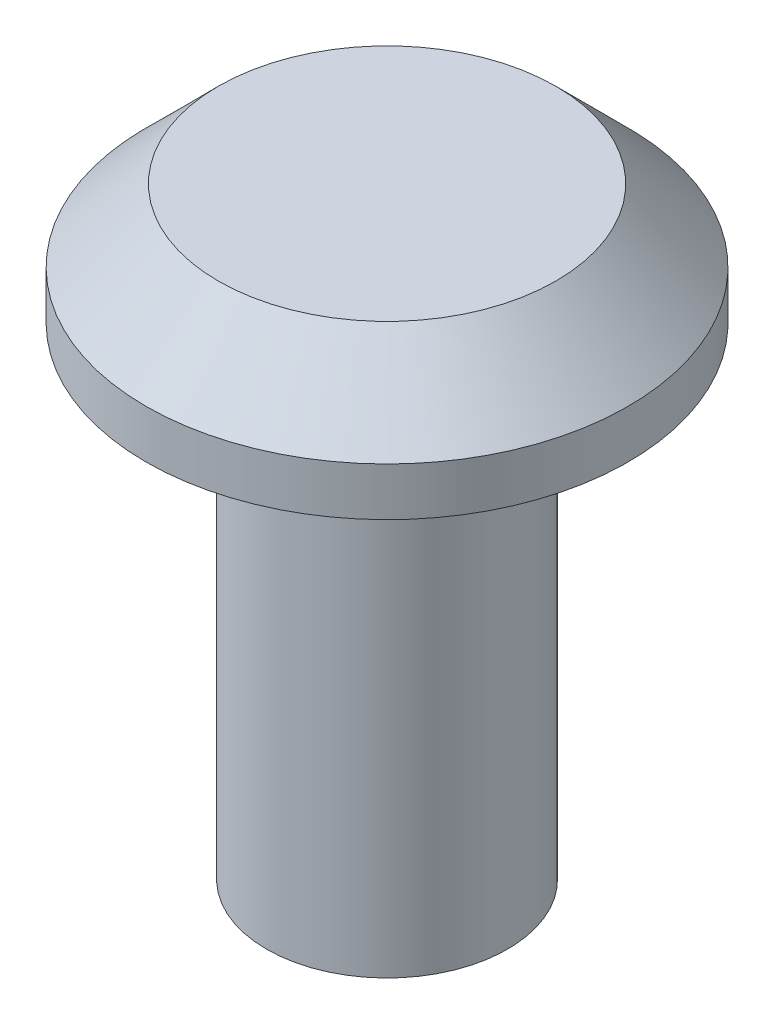
ISO-10303-21;
HEADER;
FILE_DESCRIPTION(('STEP AP214'),'2;1');
FILE_NAME('part.step','',(''),(''),'','','');
FILE_SCHEMA(('AUTOMOTIVE_DESIGN { 1 0 10303 214 1 1 1 1 }'));
ENDSEC;
DATA;
#1=APPLICATION_CONTEXT('core data for automotive mechanical design processes');
#2=APPLICATION_PROTOCOL_DEFINITION('international standard','automotive_design',2000,#1);
#3=PRODUCT_CONTEXT('',#1,'mechanical');
#4=PRODUCT('Part','Part','',(#3));
#5=PRODUCT_RELATED_PRODUCT_CATEGORY('part','',(#4));
#6=PRODUCT_DEFINITION_FORMATION('','',#4);
#7=PRODUCT_DEFINITION_CONTEXT('part definition',#1,'design');
#8=PRODUCT_DEFINITION('design','',#6,#7);
#9=PRODUCT_DEFINITION_SHAPE('','',#8);
#10=(LENGTH_UNIT() NAMED_UNIT(*) SI_UNIT(.MILLI.,.METRE.));
#11=(NAMED_UNIT(*) PLANE_ANGLE_UNIT() SI_UNIT($,.RADIAN.));
#12=(NAMED_UNIT(*) SI_UNIT($,.STERADIAN.) SOLID_ANGLE_UNIT());
#13=UNCERTAINTY_MEASURE_WITH_UNIT(LENGTH_MEASURE(1.E-05),#10,'distance_accuracy_value','');
#14=(GEOMETRIC_REPRESENTATION_CONTEXT(3) GLOBAL_UNCERTAINTY_ASSIGNED_CONTEXT((#13)) GLOBAL_UNIT_ASSIGNED_CONTEXT((#10,
#11,#12)) REPRESENTATION_CONTEXT('',''));
#15=CARTESIAN_POINT('',(0.,0.,0.));
#16=DIRECTION('',(0.,0.,1.));
#17=DIRECTION('',(1.,0.,0.));
#18=AXIS2_PLACEMENT_3D('',#15,#16,#17);
#19=CARTESIAN_POINT('',(0.,-2.25,0.));
#20=DIRECTION('',(0.,1.,0.));
#21=DIRECTION('',(0.,0.,1.));
#22=AXIS2_PLACEMENT_3D('',#19,#20,#21);
#23=CYLINDRICAL_SURFACE('',#22,0.5);
#24=CARTESIAN_POINT('',(0.,-2.25,0.));
#25=DIRECTION('',(0.,-1.,0.));
#26=DIRECTION('',(0.,0.,-1.));
#27=AXIS2_PLACEMENT_3D('',#24,#25,#26);
#28=CIRCLE('',#27,0.5);
#29=CARTESIAN_POINT('',(0.,-2.25,-0.5));
#30=VERTEX_POINT('',#29);
#31=EDGE_CURVE('E11',#30,#30,#28,.T.);
#32=ORIENTED_EDGE('',*,*,#31,.F.);
#33=EDGE_LOOP('',(#32));
#34=FACE_BOUND('',#33,.T.);
#35=CARTESIAN_POINT('',(0.,-0.25,0.));
#36=DIRECTION('',(0.,-1.,0.));
#37=DIRECTION('',(0.,0.,-1.));
#38=AXIS2_PLACEMENT_3D('',#35,#36,#37);
#39=CIRCLE('',#38,0.5);
#40=CARTESIAN_POINT('',(0.,-0.25,-0.5));
#41=VERTEX_POINT('',#40);
#42=EDGE_CURVE('E42',#41,#41,#39,.T.);
#43=ORIENTED_EDGE('',*,*,#42,.T.);
#44=EDGE_LOOP('',(#43));
#45=FACE_BOUND('',#44,.T.);
#46=ADVANCED_FACE('F39',(#34,#45),#23,.T.);
#47=CARTESIAN_POINT('',(0.,-2.25,0.));
#48=DIRECTION('',(0.,-1.,0.));
#49=DIRECTION('',(0.,0.,-1.));
#50=AXIS2_PLACEMENT_3D('',#47,#48,#49);
#51=PLANE('',#50);
#52=ORIENTED_EDGE('',*,*,#31,.T.);
#53=EDGE_LOOP('',(#52));
#54=FACE_BOUND('',#53,.T.);
#55=ADVANCED_FACE('F54',(#54),#51,.T.);
#56=CARTESIAN_POINT('',(0.,-0.25,0.));
#57=DIRECTION('',(0.,-1.,0.));
#58=DIRECTION('',(0.,0.,-1.));
#59=AXIS2_PLACEMENT_3D('',#56,#57,#58);
#60=PLANE('',#59);
#61=ORIENTED_EDGE('',*,*,#42,.F.);
#62=EDGE_LOOP('',(#61));
#63=FACE_BOUND('',#62,.T.);
#64=ADVANCED_FACE('F52',(#63),#60,.F.);
#65=CLOSED_SHELL('',(#46,#55,#64));
#66=MANIFOLD_SOLID_BREP('B2',#65);
#67=CARTESIAN_POINT('',(0.,0.25,0.));
#68=DIRECTION('',(0.,-1.,0.));
#69=DIRECTION('',(0.,0.,-1.));
#70=AXIS2_PLACEMENT_3D('',#67,#68,#69);
#71=CYLINDRICAL_SURFACE('',#70,1.);
#72=CARTESIAN_POINT('',(0.,-0.050000000000001,0.));
#73=DIRECTION('',(0.,1.,0.));
#74=DIRECTION('',(0.,0.,1.));
#75=AXIS2_PLACEMENT_3D('',#72,#73,#74);
#76=CIRCLE('',#75,1.);
#77=CARTESIAN_POINT('',(0.,-0.050000000000001,1.));
#78=VERTEX_POINT('',#77);
#79=EDGE_CURVE('E38',#78,#78,#76,.F.);
#80=ORIENTED_EDGE('',*,*,#79,.T.);
#81=EDGE_LOOP('',(#80));
#82=FACE_BOUND('',#81,.T.);
#83=CARTESIAN_POINT('',(0.,-0.25,0.));
#84=DIRECTION('',(0.,1.,0.));
#85=DIRECTION('',(0.,0.,1.));
#86=AXIS2_PLACEMENT_3D('',#83,#84,#85);
#87=CIRCLE('',#86,1.);
#88=CARTESIAN_POINT('',(0.,-0.25,1.));
#89=VERTEX_POINT('',#88);
#90=EDGE_CURVE('E91',#89,#89,#87,.T.);
#91=ORIENTED_EDGE('',*,*,#90,.T.);
#92=EDGE_LOOP('',(#91));
#93=FACE_BOUND('',#92,.T.);
#94=ADVANCED_FACE('F80',(#82,#93),#71,.T.);
#95=CARTESIAN_POINT('',(0.,0.25,0.));
#96=DIRECTION('',(0.,1.,0.));
#97=DIRECTION('',(0.,0.,1.));
#98=AXIS2_PLACEMENT_3D('',#95,#96,#97);
#99=PLANE('',#98);
#100=CARTESIAN_POINT('',(0.,0.25,0.));
#101=DIRECTION('',(0.,1.,0.));
#102=DIRECTION('',(0.,0.,1.));
#103=AXIS2_PLACEMENT_3D('',#100,#101,#102);
#104=CIRCLE('',#103,0.700000000000001);
#105=CARTESIAN_POINT('',(0.,0.25,0.700000000000001));
#106=VERTEX_POINT('',#105);
#107=EDGE_CURVE('E87',#106,#106,#104,.T.);
#108=ORIENTED_EDGE('',*,*,#107,.T.);
#109=EDGE_LOOP('',(#108));
#110=FACE_BOUND('',#109,.T.);
#111=ADVANCED_FACE('F101',(#110),#99,.T.);
#112=CARTESIAN_POINT('',(0.,-0.25,0.));
#113=DIRECTION('',(0.,1.,0.));
#114=DIRECTION('',(0.,0.,1.));
#115=AXIS2_PLACEMENT_3D('',#112,#113,#114);
#116=PLANE('',#115);
#117=ORIENTED_EDGE('',*,*,#90,.F.);
#118=EDGE_LOOP('',(#117));
#119=FACE_BOUND('',#118,.T.);
#120=ADVANCED_FACE('F99',(#119),#116,.F.);
#121=CARTESIAN_POINT('',(0.,0.25,0.));
#122=DIRECTION('',(0.,-1.,0.));
#123=DIRECTION('',(0.,0.,-1.));
#124=AXIS2_PLACEMENT_3D('',#121,#122,#123);
#125=CONICAL_SURFACE('',#124,0.700000000000001,0.785398163397446);
#126=ORIENTED_EDGE('',*,*,#79,.F.);
#127=EDGE_LOOP('',(#126));
#128=FACE_BOUND('',#127,.T.);
#129=ORIENTED_EDGE('',*,*,#107,.F.);
#130=EDGE_LOOP('',(#129));
#131=FACE_BOUND('',#130,.T.);
#132=ADVANCED_FACE('F82',(#128,#131),#125,.T.);
#133=CLOSED_SHELL('',(#94,#111,#120,#132));
#134=MANIFOLD_SOLID_BREP('B6',#133);
#135=ADVANCED_BREP_SHAPE_REPRESENTATION('',(#18,#66,#134),#14);
#136=SHAPE_DEFINITION_REPRESENTATION(#9,#135);
ENDSEC;
END-ISO-10303-21;
